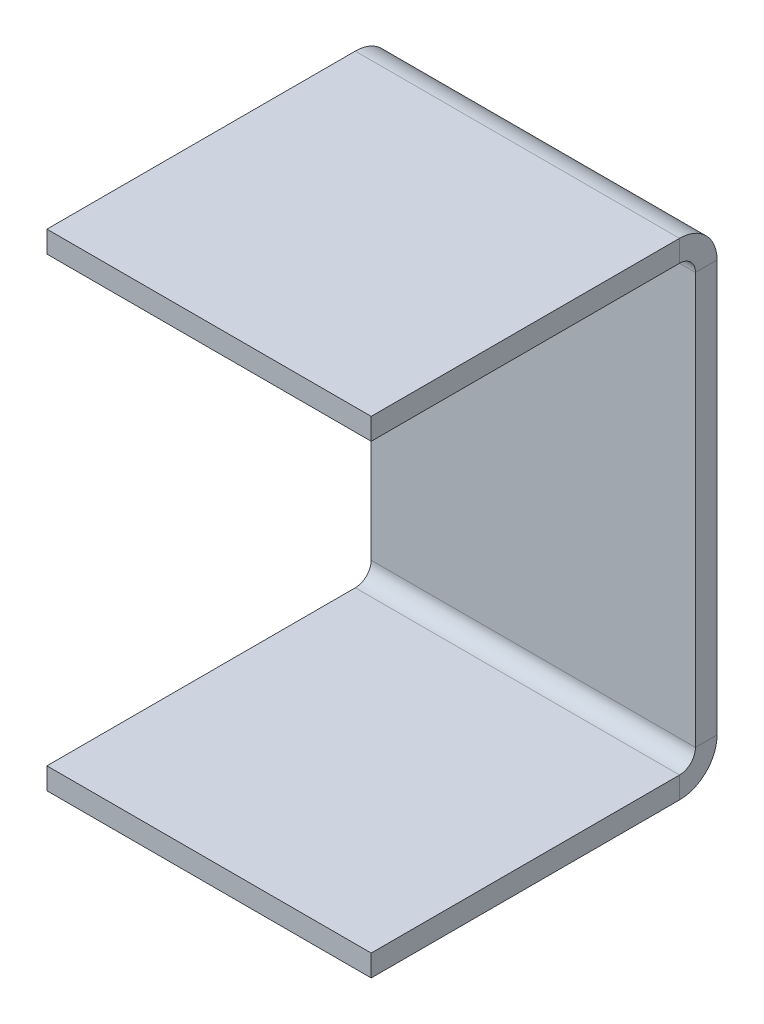
ISO-10303-21;
HEADER;
FILE_DESCRIPTION(('STEP AP214'),'2;1');
FILE_NAME('part.step','',(''),(''),'','','');
FILE_SCHEMA(('AUTOMOTIVE_DESIGN { 1 0 10303 214 1 1 1 1 }'));
ENDSEC;
DATA;
#1=APPLICATION_CONTEXT('core data for automotive mechanical design processes');
#2=APPLICATION_PROTOCOL_DEFINITION('international standard','automotive_design',2000,#1);
#3=PRODUCT_CONTEXT('',#1,'mechanical');
#4=PRODUCT('Part','Part','',(#3));
#5=PRODUCT_RELATED_PRODUCT_CATEGORY('part','',(#4));
#6=PRODUCT_DEFINITION_FORMATION('','',#4);
#7=PRODUCT_DEFINITION_CONTEXT('part definition',#1,'design');
#8=PRODUCT_DEFINITION('design','',#6,#7);
#9=PRODUCT_DEFINITION_SHAPE('','',#8);
#10=(LENGTH_UNIT() NAMED_UNIT(*) SI_UNIT(.MILLI.,.METRE.));
#11=(NAMED_UNIT(*) PLANE_ANGLE_UNIT() SI_UNIT($,.RADIAN.));
#12=(NAMED_UNIT(*) SI_UNIT($,.STERADIAN.) SOLID_ANGLE_UNIT());
#13=UNCERTAINTY_MEASURE_WITH_UNIT(LENGTH_MEASURE(1.E-05),#10,'distance_accuracy_value','');
#14=(GEOMETRIC_REPRESENTATION_CONTEXT(3) GLOBAL_UNCERTAINTY_ASSIGNED_CONTEXT((#13)) GLOBAL_UNIT_ASSIGNED_CONTEXT((#10,
#11,#12)) REPRESENTATION_CONTEXT('',''));
#15=CARTESIAN_POINT('',(0.,0.,0.));
#16=DIRECTION('',(0.,0.,1.));
#17=DIRECTION('',(1.,0.,0.));
#18=AXIS2_PLACEMENT_3D('',#15,#16,#17);
#19=CARTESIAN_POINT('',(0.,0.,-1.));
#20=DIRECTION('',(0.,0.,1.));
#21=DIRECTION('',(1.,0.,0.));
#22=AXIS2_PLACEMENT_3D('',#19,#20,#21);
#23=PLANE('',#22);
#24=DIRECTION('',(1.,0.,0.));
#25=VECTOR('',#24,1.);
#26=CARTESIAN_POINT('',(7.5,-9.5134,-1.));
#27=LINE('',#26,#25);
#28=CARTESIAN_POINT('',(7.5,-9.5134,-1.));
#29=VERTEX_POINT('',#28);
#30=CARTESIAN_POINT('',(-7.5,-9.5134,-1.));
#31=VERTEX_POINT('',#30);
#32=EDGE_CURVE('E211',#29,#31,#27,.F.);
#33=ORIENTED_EDGE('',*,*,#32,.T.);
#34=DIRECTION('',(0.,-1.,0.));
#35=VECTOR('',#34,1.);
#36=CARTESIAN_POINT('',(-7.5,-10.,-1.));
#37=LINE('',#36,#35);
#38=CARTESIAN_POINT('',(-7.5,9.5134,-1.));
#39=VERTEX_POINT('',#38);
#40=EDGE_CURVE('E88',#39,#31,#37,.T.);
#41=ORIENTED_EDGE('',*,*,#40,.F.);
#42=DIRECTION('',(-1.,0.,0.));
#43=VECTOR('',#42,1.);
#44=CARTESIAN_POINT('',(-7.5,9.5134,-1.));
#45=LINE('',#44,#43);
#46=CARTESIAN_POINT('',(7.5,9.51340000000001,-1.));
#47=VERTEX_POINT('',#46);
#48=EDGE_CURVE('E264',#39,#47,#45,.F.);
#49=ORIENTED_EDGE('',*,*,#48,.T.);
#50=DIRECTION('',(0.,1.,0.));
#51=VECTOR('',#50,1.);
#52=CARTESIAN_POINT('',(7.5,-10.,-1.));
#53=LINE('',#52,#51);
#54=EDGE_CURVE('E13',#29,#47,#53,.T.);
#55=ORIENTED_EDGE('',*,*,#54,.F.);
#56=EDGE_LOOP('',(#33,#41,#49,#55));
#57=FACE_BOUND('',#56,.T.);
#58=ADVANCED_FACE('F79',(#57),#23,.F.);
#59=CARTESIAN_POINT('',(0.,0.,0.));
#60=DIRECTION('',(0.,0.,1.));
#61=DIRECTION('',(1.,0.,0.));
#62=AXIS2_PLACEMENT_3D('',#59,#60,#61);
#63=PLANE('',#62);
#64=DIRECTION('',(0.,-1.,0.));
#65=VECTOR('',#64,1.);
#66=CARTESIAN_POINT('',(-7.5,-10.,0.));
#67=LINE('',#66,#65);
#68=CARTESIAN_POINT('',(-7.5,9.5134,0.));
#69=VERTEX_POINT('',#68);
#70=CARTESIAN_POINT('',(-7.5,-9.5134,0.));
#71=VERTEX_POINT('',#70);
#72=EDGE_CURVE('E282',#69,#71,#67,.T.);
#73=ORIENTED_EDGE('',*,*,#72,.T.);
#74=DIRECTION('',(1.,0.,0.));
#75=VECTOR('',#74,1.);
#76=CARTESIAN_POINT('',(7.5,-9.5134,0.));
#77=LINE('',#76,#75);
#78=CARTESIAN_POINT('',(7.5,-9.5134,0.));
#79=VERTEX_POINT('',#78);
#80=EDGE_CURVE('E223',#79,#71,#77,.F.);
#81=ORIENTED_EDGE('',*,*,#80,.F.);
#82=DIRECTION('',(0.,1.,0.));
#83=VECTOR('',#82,1.);
#84=CARTESIAN_POINT('',(7.5,-10.,0.));
#85=LINE('',#84,#83);
#86=CARTESIAN_POINT('',(7.5,9.5134,0.));
#87=VERTEX_POINT('',#86);
#88=EDGE_CURVE('E83',#79,#87,#85,.T.);
#89=ORIENTED_EDGE('',*,*,#88,.T.);
#90=DIRECTION('',(-1.,0.,0.));
#91=VECTOR('',#90,1.);
#92=CARTESIAN_POINT('',(-7.5,9.5134,0.));
#93=LINE('',#92,#91);
#94=EDGE_CURVE('E96',#69,#87,#93,.F.);
#95=ORIENTED_EDGE('',*,*,#94,.F.);
#96=EDGE_LOOP('',(#73,#81,#89,#95));
#97=FACE_BOUND('',#96,.T.);
#98=ADVANCED_FACE('F287',(#97),#63,.T.);
#99=CARTESIAN_POINT('',(7.5,-10.,-1.));
#100=DIRECTION('',(1.,0.,0.));
#101=DIRECTION('',(0.,0.,-1.));
#102=AXIS2_PLACEMENT_3D('',#99,#100,#101);
#103=PLANE('',#102);
#104=ORIENTED_EDGE('',*,*,#88,.F.);
#105=DIRECTION('',(0.,0.,-1.));
#106=VECTOR('',#105,1.);
#107=CARTESIAN_POINT('',(7.5,-9.5134,0.));
#108=LINE('',#107,#106);
#109=EDGE_CURVE('E217',#79,#29,#108,.T.);
#110=ORIENTED_EDGE('',*,*,#109,.T.);
#111=ORIENTED_EDGE('',*,*,#54,.T.);
#112=DIRECTION('',(0.,0.,-1.));
#113=VECTOR('',#112,1.);
#114=CARTESIAN_POINT('',(7.5,9.5134,0.));
#115=LINE('',#114,#113);
#116=EDGE_CURVE('E279',#87,#47,#115,.T.);
#117=ORIENTED_EDGE('',*,*,#116,.F.);
#118=EDGE_LOOP('',(#104,#110,#111,#117));
#119=FACE_BOUND('',#118,.T.);
#120=ADVANCED_FACE('F289',(#119),#103,.T.);
#121=CARTESIAN_POINT('',(-7.5,-10.,-1.));
#122=DIRECTION('',(-1.,0.,0.));
#123=DIRECTION('',(0.,0.,1.));
#124=AXIS2_PLACEMENT_3D('',#121,#122,#123);
#125=PLANE('',#124);
#126=DIRECTION('',(0.,0.,-1.));
#127=VECTOR('',#126,1.);
#128=CARTESIAN_POINT('',(-7.5,-9.5134,0.));
#129=LINE('',#128,#127);
#130=EDGE_CURVE('E229',#71,#31,#129,.T.);
#131=ORIENTED_EDGE('',*,*,#130,.F.);
#132=ORIENTED_EDGE('',*,*,#72,.F.);
#133=DIRECTION('',(0.,0.,-1.));
#134=VECTOR('',#133,1.);
#135=CARTESIAN_POINT('',(-7.5,9.5134,0.));
#136=LINE('',#135,#134);
#137=EDGE_CURVE('E270',#69,#39,#136,.T.);
#138=ORIENTED_EDGE('',*,*,#137,.T.);
#139=ORIENTED_EDGE('',*,*,#40,.T.);
#140=EDGE_LOOP('',(#131,#132,#138,#139));
#141=FACE_BOUND('',#140,.T.);
#142=ADVANCED_FACE('F81',(#141),#125,.T.);
#143=CARTESIAN_POINT('',(7.5,9.5134,0.7366));
#144=DIRECTION('',(1.,0.,0.));
#145=DIRECTION('',(0.,0.,-1.));
#146=AXIS2_PLACEMENT_3D('',#143,#144,#145);
#147=PLANE('',#146);
#148=DIRECTION('',(0.,-1.,0.));
#149=VECTOR('',#148,1.);
#150=CARTESIAN_POINT('',(7.5,11.25,0.736599999999993));
#151=LINE('',#150,#149);
#152=CARTESIAN_POINT('',(7.5,10.25,0.736599999999997));
#153=VERTEX_POINT('',#152);
#154=CARTESIAN_POINT('',(7.5,11.25,0.736599999999993));
#155=VERTEX_POINT('',#154);
#156=EDGE_CURVE('E232',#153,#155,#151,.F.);
#157=ORIENTED_EDGE('',*,*,#156,.F.);
#158=CARTESIAN_POINT('',(7.5,9.5134,0.7366));
#159=DIRECTION('',(-1.,0.,0.));
#160=DIRECTION('',(0.,0.,1.));
#161=AXIS2_PLACEMENT_3D('',#158,#159,#160);
#162=CIRCLE('',#161,0.7366);
#163=EDGE_CURVE('E273',#87,#153,#162,.F.);
#164=ORIENTED_EDGE('',*,*,#163,.F.);
#165=ORIENTED_EDGE('',*,*,#116,.T.);
#166=CARTESIAN_POINT('',(7.5,9.5134,0.7366));
#167=DIRECTION('',(-1.,0.,0.));
#168=DIRECTION('',(0.,0.,1.));
#169=AXIS2_PLACEMENT_3D('',#166,#167,#168);
#170=CIRCLE('',#169,1.7366);
#171=EDGE_CURVE('E266',#47,#155,#170,.F.);
#172=ORIENTED_EDGE('',*,*,#171,.T.);
#173=EDGE_LOOP('',(#157,#164,#165,#172));
#174=FACE_BOUND('',#173,.T.);
#175=ADVANCED_FACE('F297',(#174),#147,.T.);
#176=CARTESIAN_POINT('',(-7.5,9.5134,0.7366));
#177=DIRECTION('',(1.,0.,0.));
#178=DIRECTION('',(0.,0.,-1.));
#179=AXIS2_PLACEMENT_3D('',#176,#177,#178);
#180=PLANE('',#179);
#181=CARTESIAN_POINT('',(-7.5,9.5134,0.7366));
#182=DIRECTION('',(-1.,0.,0.));
#183=DIRECTION('',(0.,0.,1.));
#184=AXIS2_PLACEMENT_3D('',#181,#182,#183);
#185=CIRCLE('',#184,0.7366);
#186=CARTESIAN_POINT('',(-7.5,10.25,0.736599999999997));
#187=VERTEX_POINT('',#186);
#188=EDGE_CURVE('E237',#187,#69,#185,.T.);
#189=ORIENTED_EDGE('',*,*,#188,.F.);
#190=DIRECTION('',(0.,-1.,0.));
#191=VECTOR('',#190,1.);
#192=CARTESIAN_POINT('',(-7.5,10.25,0.736599999999997));
#193=LINE('',#192,#191);
#194=CARTESIAN_POINT('',(-7.5,11.25,0.736599999999993));
#195=VERTEX_POINT('',#194);
#196=EDGE_CURVE('E257',#187,#195,#193,.F.);
#197=ORIENTED_EDGE('',*,*,#196,.T.);
#198=CARTESIAN_POINT('',(-7.5,9.5134,0.7366));
#199=DIRECTION('',(-1.,0.,0.));
#200=DIRECTION('',(0.,0.,1.));
#201=AXIS2_PLACEMENT_3D('',#198,#199,#200);
#202=CIRCLE('',#201,1.7366);
#203=EDGE_CURVE('E267',#195,#39,#202,.T.);
#204=ORIENTED_EDGE('',*,*,#203,.T.);
#205=ORIENTED_EDGE('',*,*,#137,.F.);
#206=EDGE_LOOP('',(#189,#197,#204,#205));
#207=FACE_BOUND('',#206,.T.);
#208=ADVANCED_FACE('F318',(#207),#180,.F.);
#209=CARTESIAN_POINT('',(-7.5,9.5134,0.7366));
#210=DIRECTION('',(-1.,0.,0.));
#211=DIRECTION('',(0.,1.,0.));
#212=AXIS2_PLACEMENT_3D('',#209,#210,#211);
#213=CYLINDRICAL_SURFACE('',#212,1.7366);
#214=ORIENTED_EDGE('',*,*,#48,.F.);
#215=ORIENTED_EDGE('',*,*,#203,.F.);
#216=DIRECTION('',(-1.,0.,0.));
#217=VECTOR('',#216,1.);
#218=CARTESIAN_POINT('',(7.5,11.25,0.736599999999993));
#219=LINE('',#218,#217);
#220=EDGE_CURVE('E255',#195,#155,#219,.F.);
#221=ORIENTED_EDGE('',*,*,#220,.T.);
#222=ORIENTED_EDGE('',*,*,#171,.F.);
#223=EDGE_LOOP('',(#214,#215,#221,#222));
#224=FACE_BOUND('',#223,.T.);
#225=ADVANCED_FACE('F516',(#224),#213,.T.);
#226=CARTESIAN_POINT('',(-7.5,9.5134,0.7366));
#227=DIRECTION('',(-1.,0.,0.));
#228=DIRECTION('',(0.,1.,0.));
#229=AXIS2_PLACEMENT_3D('',#226,#227,#228);
#230=CYLINDRICAL_SURFACE('',#229,0.7366);
#231=ORIENTED_EDGE('',*,*,#94,.T.);
#232=ORIENTED_EDGE('',*,*,#163,.T.);
#233=DIRECTION('',(-1.,0.,0.));
#234=VECTOR('',#233,1.);
#235=CARTESIAN_POINT('',(7.5,10.25,0.736599999999997));
#236=LINE('',#235,#234);
#237=EDGE_CURVE('E260',#153,#187,#236,.T.);
#238=ORIENTED_EDGE('',*,*,#237,.T.);
#239=ORIENTED_EDGE('',*,*,#188,.T.);
#240=EDGE_LOOP('',(#231,#232,#238,#239));
#241=FACE_BOUND('',#240,.T.);
#242=ADVANCED_FACE('F294',(#241),#230,.F.);
#243=CARTESIAN_POINT('',(7.5,11.25,0.));
#244=DIRECTION('',(-1.,0.,0.));
#245=DIRECTION('',(0.,0.,1.));
#246=AXIS2_PLACEMENT_3D('',#243,#244,#245);
#247=PLANE('',#246);
#248=ORIENTED_EDGE('',*,*,#156,.T.);
#249=DIRECTION('',(0.,0.,-1.));
#250=VECTOR('',#249,1.);
#251=CARTESIAN_POINT('',(7.5,11.25,0.));
#252=LINE('',#251,#250);
#253=CARTESIAN_POINT('',(7.5,11.2500000000001,15.));
#254=VERTEX_POINT('',#253);
#255=EDGE_CURVE('E245',#254,#155,#252,.T.);
#256=ORIENTED_EDGE('',*,*,#255,.F.);
#257=DIRECTION('',(0.,-1.,0.));
#258=VECTOR('',#257,1.);
#259=CARTESIAN_POINT('',(7.5,11.2500000000001,15.));
#260=LINE('',#259,#258);
#261=CARTESIAN_POINT('',(7.5,10.2500000000001,15.));
#262=VERTEX_POINT('',#261);
#263=EDGE_CURVE('E238',#254,#262,#260,.T.);
#264=ORIENTED_EDGE('',*,*,#263,.T.);
#265=DIRECTION('',(0.,0.,1.));
#266=VECTOR('',#265,1.);
#267=CARTESIAN_POINT('',(7.5,10.25,0.));
#268=LINE('',#267,#266);
#269=EDGE_CURVE('E252',#262,#153,#268,.F.);
#270=ORIENTED_EDGE('',*,*,#269,.T.);
#271=EDGE_LOOP('',(#248,#256,#264,#270));
#272=FACE_BOUND('',#271,.T.);
#273=ADVANCED_FACE('F300',(#272),#247,.F.);
#274=CARTESIAN_POINT('',(-7.5,11.2500000000001,15.));
#275=DIRECTION('',(1.,0.,0.));
#276=DIRECTION('',(0.,0.,-1.));
#277=AXIS2_PLACEMENT_3D('',#274,#275,#276);
#278=PLANE('',#277);
#279=ORIENTED_EDGE('',*,*,#196,.F.);
#280=DIRECTION('',(0.,0.,-1.));
#281=VECTOR('',#280,1.);
#282=CARTESIAN_POINT('',(-7.5,10.2500000000001,15.));
#283=LINE('',#282,#281);
#284=CARTESIAN_POINT('',(-7.5,10.2500000000001,15.));
#285=VERTEX_POINT('',#284);
#286=EDGE_CURVE('E250',#187,#285,#283,.F.);
#287=ORIENTED_EDGE('',*,*,#286,.T.);
#288=DIRECTION('',(0.,-1.,0.));
#289=VECTOR('',#288,1.);
#290=CARTESIAN_POINT('',(-7.5,11.2500000000001,15.));
#291=LINE('',#290,#289);
#292=CARTESIAN_POINT('',(-7.5,11.2500000000001,15.));
#293=VERTEX_POINT('',#292);
#294=EDGE_CURVE('E234',#293,#285,#291,.T.);
#295=ORIENTED_EDGE('',*,*,#294,.F.);
#296=DIRECTION('',(0.,0.,1.));
#297=VECTOR('',#296,1.);
#298=CARTESIAN_POINT('',(-7.5,11.25,0.));
#299=LINE('',#298,#297);
#300=EDGE_CURVE('E243',#195,#293,#299,.T.);
#301=ORIENTED_EDGE('',*,*,#300,.F.);
#302=EDGE_LOOP('',(#279,#287,#295,#301));
#303=FACE_BOUND('',#302,.T.);
#304=ADVANCED_FACE('F320',(#303),#278,.F.);
#305=CARTESIAN_POINT('',(0.,11.25,0.));
#306=DIRECTION('',(0.,-1.,0.));
#307=DIRECTION('',(0.,0.,-1.));
#308=AXIS2_PLACEMENT_3D('',#305,#306,#307);
#309=PLANE('',#308);
#310=ORIENTED_EDGE('',*,*,#220,.F.);
#311=ORIENTED_EDGE('',*,*,#300,.T.);
#312=DIRECTION('',(1.,0.,0.));
#313=VECTOR('',#312,1.);
#314=CARTESIAN_POINT('',(0.,11.2500000000001,15.));
#315=LINE('',#314,#313);
#316=EDGE_CURVE('E241',#293,#254,#315,.T.);
#317=ORIENTED_EDGE('',*,*,#316,.T.);
#318=ORIENTED_EDGE('',*,*,#255,.T.);
#319=EDGE_LOOP('',(#310,#311,#317,#318));
#320=FACE_BOUND('',#319,.T.);
#321=ADVANCED_FACE('F304',(#320),#309,.F.);
#322=CARTESIAN_POINT('',(0.,10.25,0.));
#323=DIRECTION('',(0.,-1.,0.));
#324=DIRECTION('',(0.,0.,-1.));
#325=AXIS2_PLACEMENT_3D('',#322,#323,#324);
#326=PLANE('',#325);
#327=ORIENTED_EDGE('',*,*,#286,.F.);
#328=ORIENTED_EDGE('',*,*,#237,.F.);
#329=ORIENTED_EDGE('',*,*,#269,.F.);
#330=DIRECTION('',(-1.,0.,0.));
#331=VECTOR('',#330,1.);
#332=CARTESIAN_POINT('',(7.5,10.2500000000001,15.));
#333=LINE('',#332,#331);
#334=EDGE_CURVE('E248',#285,#262,#333,.F.);
#335=ORIENTED_EDGE('',*,*,#334,.F.);
#336=EDGE_LOOP('',(#327,#328,#329,#335));
#337=FACE_BOUND('',#336,.T.);
#338=ADVANCED_FACE('F314',(#337),#326,.T.);
#339=CARTESIAN_POINT('',(7.5,11.2500000000001,15.));
#340=DIRECTION('',(0.,0.,-1.));
#341=DIRECTION('',(0.,1.,0.));
#342=AXIS2_PLACEMENT_3D('',#339,#340,#341);
#343=PLANE('',#342);
#344=ORIENTED_EDGE('',*,*,#334,.T.);
#345=ORIENTED_EDGE('',*,*,#263,.F.);
#346=ORIENTED_EDGE('',*,*,#316,.F.);
#347=ORIENTED_EDGE('',*,*,#294,.T.);
#348=EDGE_LOOP('',(#344,#345,#346,#347));
#349=FACE_BOUND('',#348,.T.);
#350=ADVANCED_FACE('F310',(#349),#343,.F.);
#351=CARTESIAN_POINT('',(-7.5,-9.5134,0.7366));
#352=DIRECTION('',(-1.,0.,0.));
#353=DIRECTION('',(0.,0.,1.));
#354=AXIS2_PLACEMENT_3D('',#351,#352,#353);
#355=PLANE('',#354);
#356=DIRECTION('',(0.,1.,0.));
#357=VECTOR('',#356,1.);
#358=CARTESIAN_POINT('',(-7.5,-11.25,0.736599999999993));
#359=LINE('',#358,#357);
#360=CARTESIAN_POINT('',(-7.5,-10.25,0.736599999999997));
#361=VERTEX_POINT('',#360);
#362=CARTESIAN_POINT('',(-7.5,-11.25,0.736599999999993));
#363=VERTEX_POINT('',#362);
#364=EDGE_CURVE('E194',#361,#363,#359,.F.);
#365=ORIENTED_EDGE('',*,*,#364,.F.);
#366=CARTESIAN_POINT('',(-7.5,-9.5134,0.7366));
#367=DIRECTION('',(1.,0.,0.));
#368=DIRECTION('',(0.,0.,-1.));
#369=AXIS2_PLACEMENT_3D('',#366,#367,#368);
#370=CIRCLE('',#369,0.7366);
#371=EDGE_CURVE('E220',#71,#361,#370,.F.);
#372=ORIENTED_EDGE('',*,*,#371,.F.);
#373=ORIENTED_EDGE('',*,*,#130,.T.);
#374=CARTESIAN_POINT('',(-7.5,-9.5134,0.7366));
#375=DIRECTION('',(1.,0.,0.));
#376=DIRECTION('',(0.,0.,-1.));
#377=AXIS2_PLACEMENT_3D('',#374,#375,#376);
#378=CIRCLE('',#377,1.7366);
#379=EDGE_CURVE('E213',#31,#363,#378,.F.);
#380=ORIENTED_EDGE('',*,*,#379,.T.);
#381=EDGE_LOOP('',(#365,#372,#373,#380));
#382=FACE_BOUND('',#381,.T.);
#383=ADVANCED_FACE('F350',(#382),#355,.T.);
#384=CARTESIAN_POINT('',(7.5,-9.5134,0.7366));
#385=DIRECTION('',(-1.,0.,0.));
#386=DIRECTION('',(0.,0.,1.));
#387=AXIS2_PLACEMENT_3D('',#384,#385,#386);
#388=PLANE('',#387);
#389=CARTESIAN_POINT('',(7.5,-9.5134,0.7366));
#390=DIRECTION('',(1.,0.,0.));
#391=DIRECTION('',(0.,0.,-1.));
#392=AXIS2_PLACEMENT_3D('',#389,#390,#391);
#393=CIRCLE('',#392,0.7366);
#394=CARTESIAN_POINT('',(7.5,-10.25,0.736599999999997));
#395=VERTEX_POINT('',#394);
#396=EDGE_CURVE('E226',#395,#79,#393,.T.);
#397=ORIENTED_EDGE('',*,*,#396,.F.);
#398=DIRECTION('',(0.,1.,0.));
#399=VECTOR('',#398,1.);
#400=CARTESIAN_POINT('',(7.5,-10.25,0.736599999999997));
#401=LINE('',#400,#399);
#402=CARTESIAN_POINT('',(7.5,-11.25,0.736599999999993));
#403=VERTEX_POINT('',#402);
#404=EDGE_CURVE('E205',#395,#403,#401,.F.);
#405=ORIENTED_EDGE('',*,*,#404,.T.);
#406=CARTESIAN_POINT('',(7.5,-9.5134,0.7366));
#407=DIRECTION('',(1.,0.,0.));
#408=DIRECTION('',(0.,0.,-1.));
#409=AXIS2_PLACEMENT_3D('',#406,#407,#408);
#410=CIRCLE('',#409,1.7366);
#411=EDGE_CURVE('E214',#403,#29,#410,.T.);
#412=ORIENTED_EDGE('',*,*,#411,.T.);
#413=ORIENTED_EDGE('',*,*,#109,.F.);
#414=EDGE_LOOP('',(#397,#405,#412,#413));
#415=FACE_BOUND('',#414,.T.);
#416=ADVANCED_FACE('F366',(#415),#388,.F.);
#417=CARTESIAN_POINT('',(7.5,-9.5134,0.7366));
#418=DIRECTION('',(1.,0.,0.));
#419=DIRECTION('',(0.,-1.,0.));
#420=AXIS2_PLACEMENT_3D('',#417,#418,#419);
#421=CYLINDRICAL_SURFACE('',#420,1.7366);
#422=ORIENTED_EDGE('',*,*,#32,.F.);
#423=ORIENTED_EDGE('',*,*,#411,.F.);
#424=DIRECTION('',(1.,0.,0.));
#425=VECTOR('',#424,1.);
#426=CARTESIAN_POINT('',(-7.5,-11.25,0.736599999999993));
#427=LINE('',#426,#425);
#428=EDGE_CURVE('E203',#403,#363,#427,.F.);
#429=ORIENTED_EDGE('',*,*,#428,.T.);
#430=ORIENTED_EDGE('',*,*,#379,.F.);
#431=EDGE_LOOP('',(#422,#423,#429,#430));
#432=FACE_BOUND('',#431,.T.);
#433=ADVANCED_FACE('F353',(#432),#421,.T.);
#434=CARTESIAN_POINT('',(7.5,-9.5134,0.7366));
#435=DIRECTION('',(1.,0.,0.));
#436=DIRECTION('',(0.,-1.,0.));
#437=AXIS2_PLACEMENT_3D('',#434,#435,#436);
#438=CYLINDRICAL_SURFACE('',#437,0.7366);
#439=ORIENTED_EDGE('',*,*,#80,.T.);
#440=ORIENTED_EDGE('',*,*,#371,.T.);
#441=DIRECTION('',(1.,0.,0.));
#442=VECTOR('',#441,1.);
#443=CARTESIAN_POINT('',(-7.5,-10.25,0.736599999999997));
#444=LINE('',#443,#442);
#445=EDGE_CURVE('E208',#361,#395,#444,.T.);
#446=ORIENTED_EDGE('',*,*,#445,.T.);
#447=ORIENTED_EDGE('',*,*,#396,.T.);
#448=EDGE_LOOP('',(#439,#440,#446,#447));
#449=FACE_BOUND('',#448,.T.);
#450=ADVANCED_FACE('F364',(#449),#438,.F.);
#451=CARTESIAN_POINT('',(-7.5,-11.25,0.));
#452=DIRECTION('',(1.,0.,0.));
#453=DIRECTION('',(0.,0.,-1.));
#454=AXIS2_PLACEMENT_3D('',#451,#452,#453);
#455=PLANE('',#454);
#456=ORIENTED_EDGE('',*,*,#364,.T.);
#457=DIRECTION('',(0.,0.,-1.));
#458=VECTOR('',#457,1.);
#459=CARTESIAN_POINT('',(-7.5,-11.25,0.));
#460=LINE('',#459,#458);
#461=CARTESIAN_POINT('',(-7.5,-11.2500000000001,15.));
#462=VERTEX_POINT('',#461);
#463=EDGE_CURVE('E175',#462,#363,#460,.T.);
#464=ORIENTED_EDGE('',*,*,#463,.F.);
#465=DIRECTION('',(0.,1.,0.));
#466=VECTOR('',#465,1.);
#467=CARTESIAN_POINT('',(-7.5,-11.2500000000001,15.));
#468=LINE('',#467,#466);
#469=CARTESIAN_POINT('',(-7.5,-10.2500000000001,15.));
#470=VERTEX_POINT('',#469);
#471=EDGE_CURVE('E181',#462,#470,#468,.T.);
#472=ORIENTED_EDGE('',*,*,#471,.T.);
#473=DIRECTION('',(0.,0.,1.));
#474=VECTOR('',#473,1.);
#475=CARTESIAN_POINT('',(-7.5,-10.25,0.));
#476=LINE('',#475,#474);
#477=EDGE_CURVE('E201',#470,#361,#476,.F.);
#478=ORIENTED_EDGE('',*,*,#477,.T.);
#479=EDGE_LOOP('',(#456,#464,#472,#478));
#480=FACE_BOUND('',#479,.T.);
#481=ADVANCED_FACE('F193',(#480),#455,.F.);
#482=CARTESIAN_POINT('',(7.5,-11.2500000000001,15.));
#483=DIRECTION('',(-1.,0.,0.));
#484=DIRECTION('',(0.,0.,1.));
#485=AXIS2_PLACEMENT_3D('',#482,#483,#484);
#486=PLANE('',#485);
#487=ORIENTED_EDGE('',*,*,#404,.F.);
#488=DIRECTION('',(0.,0.,-1.));
#489=VECTOR('',#488,1.);
#490=CARTESIAN_POINT('',(7.5,-10.2500000000001,15.));
#491=LINE('',#490,#489);
#492=CARTESIAN_POINT('',(7.5,-10.2500000000001,15.));
#493=VERTEX_POINT('',#492);
#494=EDGE_CURVE('E197',#395,#493,#491,.F.);
#495=ORIENTED_EDGE('',*,*,#494,.T.);
#496=DIRECTION('',(0.,1.,0.));
#497=VECTOR('',#496,1.);
#498=CARTESIAN_POINT('',(7.5,-11.2500000000001,15.));
#499=LINE('',#498,#497);
#500=CARTESIAN_POINT('',(7.5,-11.2500000000001,15.));
#501=VERTEX_POINT('',#500);
#502=EDGE_CURVE('E190',#501,#493,#499,.T.);
#503=ORIENTED_EDGE('',*,*,#502,.F.);
#504=DIRECTION('',(0.,0.,1.));
#505=VECTOR('',#504,1.);
#506=CARTESIAN_POINT('',(7.5,-11.25,0.));
#507=LINE('',#506,#505);
#508=EDGE_CURVE('E177',#403,#501,#507,.T.);
#509=ORIENTED_EDGE('',*,*,#508,.F.);
#510=EDGE_LOOP('',(#487,#495,#503,#509));
#511=FACE_BOUND('',#510,.T.);
#512=ADVANCED_FACE('F356',(#511),#486,.F.);
#513=CARTESIAN_POINT('',(0.,-11.25,0.));
#514=DIRECTION('',(0.,1.,0.));
#515=DIRECTION('',(0.,0.,1.));
#516=AXIS2_PLACEMENT_3D('',#513,#514,#515);
#517=PLANE('',#516);
#518=ORIENTED_EDGE('',*,*,#428,.F.);
#519=ORIENTED_EDGE('',*,*,#508,.T.);
#520=DIRECTION('',(-1.,0.,0.));
#521=VECTOR('',#520,1.);
#522=CARTESIAN_POINT('',(0.,-11.2500000000001,15.));
#523=LINE('',#522,#521);
#524=EDGE_CURVE('E170',#501,#462,#523,.T.);
#525=ORIENTED_EDGE('',*,*,#524,.T.);
#526=ORIENTED_EDGE('',*,*,#463,.T.);
#527=EDGE_LOOP('',(#518,#519,#525,#526));
#528=FACE_BOUND('',#527,.T.);
#529=ADVANCED_FACE('F173',(#528),#517,.F.);
#530=CARTESIAN_POINT('',(0.,-10.25,0.));
#531=DIRECTION('',(0.,1.,0.));
#532=DIRECTION('',(0.,0.,1.));
#533=AXIS2_PLACEMENT_3D('',#530,#531,#532);
#534=PLANE('',#533);
#535=ORIENTED_EDGE('',*,*,#494,.F.);
#536=ORIENTED_EDGE('',*,*,#445,.F.);
#537=ORIENTED_EDGE('',*,*,#477,.F.);
#538=DIRECTION('',(1.,0.,0.));
#539=VECTOR('',#538,1.);
#540=CARTESIAN_POINT('',(-7.5,-10.2500000000001,15.));
#541=LINE('',#540,#539);
#542=EDGE_CURVE('E186',#493,#470,#541,.F.);
#543=ORIENTED_EDGE('',*,*,#542,.F.);
#544=EDGE_LOOP('',(#535,#536,#537,#543));
#545=FACE_BOUND('',#544,.T.);
#546=ADVANCED_FACE('F360',(#545),#534,.T.);
#547=CARTESIAN_POINT('',(-7.5,-11.2500000000001,15.));
#548=DIRECTION('',(0.,0.,-1.));
#549=DIRECTION('',(0.,1.,0.));
#550=AXIS2_PLACEMENT_3D('',#547,#548,#549);
#551=PLANE('',#550);
#552=ORIENTED_EDGE('',*,*,#542,.T.);
#553=ORIENTED_EDGE('',*,*,#471,.F.);
#554=ORIENTED_EDGE('',*,*,#524,.F.);
#555=ORIENTED_EDGE('',*,*,#502,.T.);
#556=EDGE_LOOP('',(#552,#553,#554,#555));
#557=FACE_BOUND('',#556,.T.);
#558=ADVANCED_FACE('F184',(#557),#551,.F.);
#559=CLOSED_SHELL('',(#58,#98,#120,#142,#175,#208,#225,#242,#273,#304,#321,#338,#350,#383,#416,
#433,#450,#481,#512,#529,#546,#558));
#560=MANIFOLD_SOLID_BREP('B2',#559);
#561=ADVANCED_BREP_SHAPE_REPRESENTATION('',(#18,#560),#14);
#562=SHAPE_DEFINITION_REPRESENTATION(#9,#561);
ENDSEC;
END-ISO-10303-21;
